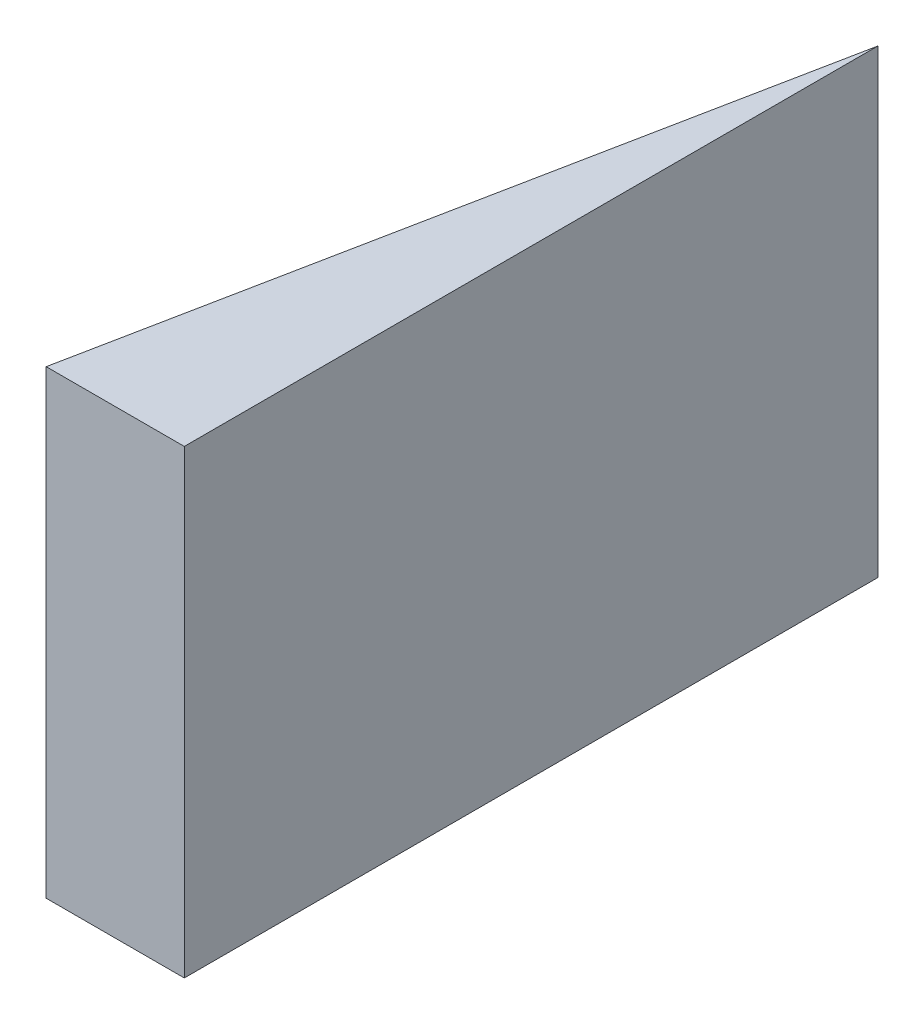
ISO-10303-21;
HEADER;
FILE_DESCRIPTION(('STEP AP214'),'2;1');
FILE_NAME('part.step','',(''),(''),'','','');
FILE_SCHEMA(('AUTOMOTIVE_DESIGN { 1 0 10303 214 1 1 1 1 }'));
ENDSEC;
DATA;
#1=APPLICATION_CONTEXT('core data for automotive mechanical design processes');
#2=APPLICATION_PROTOCOL_DEFINITION('international standard','automotive_design',2000,#1);
#3=PRODUCT_CONTEXT('',#1,'mechanical');
#4=PRODUCT('Part','Part','',(#3));
#5=PRODUCT_RELATED_PRODUCT_CATEGORY('part','',(#4));
#6=PRODUCT_DEFINITION_FORMATION('','',#4);
#7=PRODUCT_DEFINITION_CONTEXT('part definition',#1,'design');
#8=PRODUCT_DEFINITION('design','',#6,#7);
#9=PRODUCT_DEFINITION_SHAPE('','',#8);
#10=(LENGTH_UNIT() NAMED_UNIT(*) SI_UNIT(.MILLI.,.METRE.));
#11=(NAMED_UNIT(*) PLANE_ANGLE_UNIT() SI_UNIT($,.RADIAN.));
#12=(NAMED_UNIT(*) SI_UNIT($,.STERADIAN.) SOLID_ANGLE_UNIT());
#13=UNCERTAINTY_MEASURE_WITH_UNIT(LENGTH_MEASURE(1.E-05),#10,'distance_accuracy_value','');
#14=(GEOMETRIC_REPRESENTATION_CONTEXT(3) GLOBAL_UNCERTAINTY_ASSIGNED_CONTEXT((#13)) GLOBAL_UNIT_ASSIGNED_CONTEXT((#10,
#11,#12)) REPRESENTATION_CONTEXT('',''));
#15=CARTESIAN_POINT('',(0.,0.,0.));
#16=DIRECTION('',(0.,0.,1.));
#17=DIRECTION('',(1.,0.,0.));
#18=AXIS2_PLACEMENT_3D('',#15,#16,#17);
#19=CARTESIAN_POINT('',(-3.37532140033029,1.75000054485265,-5.23287720051423));
#20=DIRECTION('',(-1.74845553146952E-07,-1.,-8.74227765734759E-08));
#21=DIRECTION('',(1.,-1.74845553146952E-07,0.));
#22=AXIS2_PLACEMENT_3D('',#19,#20,#21);
#23=PLANE('',#22);
#24=DIRECTION('',(-0.999999999999985,1.7484555285089E-07,0.));
#25=VECTOR('',#24,1.);
#26=CARTESIAN_POINT('',(-2.99999969402031,1.75000034094783,-3.65112136800623));
#27=LINE('',#26,#25);
#28=CARTESIAN_POINT('',(-2.99999969402031,1.75000034094683,-3.65112136800623));
#29=VERTEX_POINT('',#28);
#30=CARTESIAN_POINT('',(-3.29999969402031,1.75000039340049,-3.65112136800723));
#31=VERTEX_POINT('',#30);
#32=EDGE_CURVE('E11',#29,#31,#27,.T.);
#33=ORIENTED_EDGE('',*,*,#32,.F.);
#34=DIRECTION('',(0.,-8.74227765663743E-08,0.999999999999996));
#35=VECTOR('',#34,1.);
#36=CARTESIAN_POINT('',(-2.99999969402029,1.75000047264448,-5.15755549420424));
#37=LINE('',#36,#35);
#38=CARTESIAN_POINT('',(-2.99999969402029,1.75000047264348,-5.15755549420324));
#39=VERTEX_POINT('',#38);
#40=EDGE_CURVE('E63',#39,#29,#37,.T.);
#41=ORIENTED_EDGE('',*,*,#40,.F.);
#42=DIRECTION('',(0.195310522456633,5.15899647358687E-08,-0.980741454114036));
#43=VECTOR('',#42,1.);
#44=CARTESIAN_POINT('',(-3.29999969402031,1.75000039340149,-3.65112136800623));
#45=LINE('',#44,#43);
#46=EDGE_CURVE('E70',#31,#39,#45,.T.);
#47=ORIENTED_EDGE('',*,*,#46,.F.);
#48=EDGE_LOOP('',(#33,#41,#47));
#49=FACE_BOUND('',#48,.T.);
#50=ADVANCED_FACE('F17',(#49),#23,.F.);
#51=CARTESIAN_POINT('',(-3.37532157517584,0.750000544852647,-5.23287728793701));
#52=DIRECTION('',(-1.74845553146952E-07,-1.,-8.74227765734759E-08));
#53=DIRECTION('',(1.,-1.74845553146952E-07,0.));
#54=AXIS2_PLACEMENT_3D('',#51,#52,#53);
#55=PLANE('',#54);
#56=DIRECTION('',(0.195310522456633,5.15899646635893E-08,-0.980741454114036));
#57=VECTOR('',#56,1.);
#58=CARTESIAN_POINT('',(-3.29999986886587,0.750000393401495,-3.65112145542901));
#59=LINE('',#58,#57);
#60=CARTESIAN_POINT('',(-3.29999986886587,0.750000393402495,-3.65112145543001));
#61=VERTEX_POINT('',#60);
#62=CARTESIAN_POINT('',(-2.99999986886584,0.750000472645483,-5.15755558162601));
#63=VERTEX_POINT('',#62);
#64=EDGE_CURVE('E24',#61,#63,#59,.T.);
#65=ORIENTED_EDGE('',*,*,#64,.T.);
#66=DIRECTION('',(0.,-8.74227765663743E-08,0.999999999999996));
#67=VECTOR('',#66,1.);
#68=CARTESIAN_POINT('',(-2.99999986886584,0.750000472644483,-5.15755558162701));
#69=LINE('',#68,#67);
#70=CARTESIAN_POINT('',(-2.99999986886587,0.750000340948829,-3.65112145542901));
#71=VERTEX_POINT('',#70);
#72=EDGE_CURVE('E49',#63,#71,#69,.T.);
#73=ORIENTED_EDGE('',*,*,#72,.T.);
#74=DIRECTION('',(-0.999999999999985,1.74845553220964E-07,0.));
#75=VECTOR('',#74,1.);
#76=CARTESIAN_POINT('',(-2.99999986886587,0.750000340947829,-3.65112145542901));
#77=LINE('',#76,#75);
#78=EDGE_CURVE('E46',#71,#61,#77,.T.);
#79=ORIENTED_EDGE('',*,*,#78,.T.);
#80=EDGE_LOOP('',(#65,#73,#79));
#81=FACE_BOUND('',#80,.T.);
#82=ADVANCED_FACE('F47',(#81),#55,.T.);
#83=CARTESIAN_POINT('',(-3.29999969402031,1.75000039340149,-3.65112136800623));
#84=DIRECTION('',(-0.980741454114038,1.88552870228038E-07,-0.195310522456619));
#85=DIRECTION('',(0.195310522456634,5.15899646850099E-08,-0.980741454114041));
#86=AXIS2_PLACEMENT_3D('',#83,#84,#85);
#87=PLANE('',#86);
#88=ORIENTED_EDGE('',*,*,#46,.T.);
#89=DIRECTION('',(-1.74845553146948E-07,-0.999999999999981,-8.74227765734742E-08));
#90=VECTOR('',#89,1.);
#91=CARTESIAN_POINT('',(-2.99999969402029,1.75000047264448,-5.15755549420423));
#92=LINE('',#91,#90);
#93=EDGE_CURVE('E54',#39,#63,#92,.T.);
#94=ORIENTED_EDGE('',*,*,#93,.T.);
#95=ORIENTED_EDGE('',*,*,#64,.F.);
#96=DIRECTION('',(-1.74845553146948E-07,-0.999999999999981,-8.74227765734742E-08));
#97=VECTOR('',#96,1.);
#98=CARTESIAN_POINT('',(-3.29999969402031,1.75000039340149,-3.65112136800623));
#99=LINE('',#98,#97);
#100=EDGE_CURVE('E61',#31,#61,#99,.T.);
#101=ORIENTED_EDGE('',*,*,#100,.F.);
#102=EDGE_LOOP('',(#88,#94,#95,#101));
#103=FACE_BOUND('',#102,.T.);
#104=ADVANCED_FACE('F60',(#103),#87,.T.);
#105=CARTESIAN_POINT('',(-2.99999969402029,1.75000047264448,-5.15755549420424));
#106=DIRECTION('',(1.,-1.74845553146952E-07,0.));
#107=DIRECTION('',(0.,-8.74227765734759E-08,1.));
#108=AXIS2_PLACEMENT_3D('',#105,#106,#107);
#109=PLANE('',#108);
#110=ORIENTED_EDGE('',*,*,#40,.T.);
#111=DIRECTION('',(-1.74845553146948E-07,-0.999999999999981,-8.74227765734742E-08));
#112=VECTOR('',#111,1.);
#113=CARTESIAN_POINT('',(-2.99999969402031,1.75000034094783,-3.65112136800624));
#114=LINE('',#113,#112);
#115=EDGE_CURVE('E55',#29,#71,#114,.T.);
#116=ORIENTED_EDGE('',*,*,#115,.T.);
#117=ORIENTED_EDGE('',*,*,#72,.F.);
#118=ORIENTED_EDGE('',*,*,#93,.F.);
#119=EDGE_LOOP('',(#110,#116,#117,#118));
#120=FACE_BOUND('',#119,.T.);
#121=ADVANCED_FACE('F73',(#120),#109,.T.);
#122=CARTESIAN_POINT('',(-2.99999969402031,1.75000034094783,-3.65112136800623));
#123=DIRECTION('',(0.,-8.74227765734759E-08,1.));
#124=DIRECTION('',(-1.,1.74845553146952E-07,0.));
#125=AXIS2_PLACEMENT_3D('',#122,#123,#124);
#126=PLANE('',#125);
#127=ORIENTED_EDGE('',*,*,#32,.T.);
#128=ORIENTED_EDGE('',*,*,#100,.T.);
#129=ORIENTED_EDGE('',*,*,#78,.F.);
#130=ORIENTED_EDGE('',*,*,#115,.F.);
#131=EDGE_LOOP('',(#127,#128,#129,#130));
#132=FACE_BOUND('',#131,.T.);
#133=ADVANCED_FACE('F64',(#132),#126,.T.);
#134=CLOSED_SHELL('',(#50,#82,#104,#121,#133));
#135=MANIFOLD_SOLID_BREP('B1',#134);
#136=ADVANCED_BREP_SHAPE_REPRESENTATION('',(#18,#135),#14);
#137=SHAPE_DEFINITION_REPRESENTATION(#9,#136);
ENDSEC;
END-ISO-10303-21;
